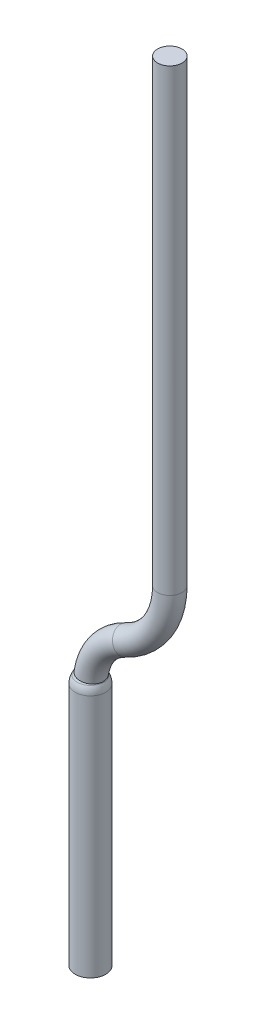
ISO-10303-21;
HEADER;
FILE_DESCRIPTION(('STEP AP214'),'2;1');
FILE_NAME('part.step','',(''),(''),'','','');
FILE_SCHEMA(('AUTOMOTIVE_DESIGN { 1 0 10303 214 1 1 1 1 }'));
ENDSEC;
DATA;
#1=APPLICATION_CONTEXT('core data for automotive mechanical design processes');
#2=APPLICATION_PROTOCOL_DEFINITION('international standard','automotive_design',2000,#1);
#3=PRODUCT_CONTEXT('',#1,'mechanical');
#4=PRODUCT('Part','Part','',(#3));
#5=PRODUCT_RELATED_PRODUCT_CATEGORY('part','',(#4));
#6=PRODUCT_DEFINITION_FORMATION('','',#4);
#7=PRODUCT_DEFINITION_CONTEXT('part definition',#1,'design');
#8=PRODUCT_DEFINITION('design','',#6,#7);
#9=PRODUCT_DEFINITION_SHAPE('','',#8);
#10=(LENGTH_UNIT() NAMED_UNIT(*) SI_UNIT(.MILLI.,.METRE.));
#11=(NAMED_UNIT(*) PLANE_ANGLE_UNIT() SI_UNIT($,.RADIAN.));
#12=(NAMED_UNIT(*) SI_UNIT($,.STERADIAN.) SOLID_ANGLE_UNIT());
#13=UNCERTAINTY_MEASURE_WITH_UNIT(LENGTH_MEASURE(1.E-05),#10,'distance_accuracy_value','');
#14=(GEOMETRIC_REPRESENTATION_CONTEXT(3) GLOBAL_UNCERTAINTY_ASSIGNED_CONTEXT((#13)) GLOBAL_UNIT_ASSIGNED_CONTEXT((#10,
#11,#12)) REPRESENTATION_CONTEXT('',''));
#15=CARTESIAN_POINT('',(0.,0.,0.));
#16=DIRECTION('',(0.,0.,1.));
#17=DIRECTION('',(1.,0.,0.));
#18=AXIS2_PLACEMENT_3D('',#15,#16,#17);
#19=CARTESIAN_POINT('',(-8.7,16.,0.));
#20=DIRECTION('',(0.,0.,-1.));
#21=DIRECTION('',(-1.,0.,0.));
#22=AXIS2_PLACEMENT_3D('',#19,#20,#21);
#23=TOROIDAL_SURFACE('',#22,4.,0.800000000000001);
#24=CARTESIAN_POINT('',(-10.3888888888889,19.6259694318882,0.));
#25=DIRECTION('',(0.90649235797205,0.422222222222223,0.));
#26=DIRECTION('',(0.,0.,1.));
#27=AXIS2_PLACEMENT_3D('',#24,#25,#26);
#28=CIRCLE('',#27,0.800000000000001);
#29=CARTESIAN_POINT('',(-10.0511111111111,18.9007755455106,0.));
#30=VERTEX_POINT('',#29);
#31=EDGE_CURVE('E48',#30,#30,#28,.T.);
#32=ORIENTED_EDGE('',*,*,#31,.F.);
#33=EDGE_LOOP('',(#32));
#34=FACE_BOUND('',#33,.T.);
#35=CARTESIAN_POINT('',(-13.2346140650629,16.6765861332044,-0.545889997202599));
#36=CARTESIAN_POINT('',(-13.2638503445764,16.6801945734031,-0.514339404259527));
#37=CARTESIAN_POINT('',(-13.2905534843033,16.6835623552442,-0.480381533787737));
#38=CARTESIAN_POINT('',(-13.3381810589157,16.6896659268197,-0.408543649052486));
#39=CARTESIAN_POINT('',(-13.3590994635792,16.6924010565723,-0.370659598108414));
#40=CARTESIAN_POINT('',(-13.3953088572261,16.6971926309274,-0.290391115693819));
#41=CARTESIAN_POINT('',(-13.410339556413,16.6992173400108,-0.247886938844708));
#42=CARTESIAN_POINT('',(-13.4331121434719,16.7023057109485,-0.160942293956431));
#43=CARTESIAN_POINT('',(-13.4408546754975,16.7033694577357,-0.116501997401575));
#44=CARTESIAN_POINT('',(-13.4488428644601,16.7044671928645,-0.0269257410162937));
#45=CARTESIAN_POINT('',(-13.4490862314188,16.7045008666584,0.0182104270989871));
#46=CARTESIAN_POINT('',(-13.4420629002413,16.7035353183585,0.107883743578252));
#47=CARTESIAN_POINT('',(-13.4347961253336,16.7025360857061,0.152420885814053));
#48=CARTESIAN_POINT('',(-13.4129527177559,16.6995701290988,0.239634374402971));
#49=CARTESIAN_POINT('',(-13.3983756379391,16.6976033459624,0.282310606756926));
#50=CARTESIAN_POINT('',(-13.3623159671288,16.6928227079279,0.364587439798731));
#51=CARTESIAN_POINT('',(-13.3408333750792,16.6900088529002,0.404188040016206));
#52=CARTESIAN_POINT('',(-13.2915666839138,16.6836894069879,0.479182609635002));
#53=CARTESIAN_POINT('',(-13.2637836013066,16.6801839277004,0.514577256214246));
#54=CARTESIAN_POINT('',(-13.2026949593381,16.6726490894042,0.580162206612931));
#55=CARTESIAN_POINT('',(-13.1693894277402,16.6686197330292,0.610352536594908));
#56=CARTESIAN_POINT('',(-13.0982054327717,16.6602034888587,0.664666790614329));
#57=CARTESIAN_POINT('',(-13.0603280444307,16.6558166851921,0.688792136679128));
#58=CARTESIAN_POINT('',(-12.9810676767912,16.6468376348628,0.730304794888743));
#59=CARTESIAN_POINT('',(-12.9396846877456,16.6422453876289,0.747692088297826));
#60=CARTESIAN_POINT('',(-12.8545638813539,16.632989621015,0.775248976130836));
#61=CARTESIAN_POINT('',(-12.8108247777748,16.6283260637213,0.785414584291591));
#62=CARTESIAN_POINT('',(-12.7222538677904,16.6190508552055,0.798231425057475));
#63=CARTESIAN_POINT('',(-12.6774220516093,16.6144392044483,0.80088259041153));
#64=CARTESIAN_POINT('',(-12.5878637156915,16.6053670551967,0.798599979621444));
#65=CARTESIAN_POINT('',(-12.5431374812625,16.6009068117267,0.793653997875128));
#66=CARTESIAN_POINT('',(-12.4551315581246,16.5922407802217,0.776298989369264));
#67=CARTESIAN_POINT('',(-12.4118518848724,16.5880349949052,0.763889882891669));
#68=CARTESIAN_POINT('',(-12.3279020343815,16.5799581292398,0.731936343318497));
#69=CARTESIAN_POINT('',(-12.2872359397098,16.5760875694054,0.712381051409085));
#70=CARTESIAN_POINT('',(-12.2097434090156,16.5687676360886,0.666690243307124));
#71=CARTESIAN_POINT('',(-12.1729169842165,16.5653182638373,0.640554707881169));
#72=CARTESIAN_POINT('',(-12.104156308862,16.5589129277779,0.582440668497111));
#73=CARTESIAN_POINT('',(-12.0722220195902,16.5559569600649,0.550462210784189));
#74=CARTESIAN_POINT('',(-12.0141632049059,16.5506028113775,0.481565731503152));
#75=CARTESIAN_POINT('',(-11.9880386235085,16.548204625028,0.444647757539857));
#76=CARTESIAN_POINT('',(-11.9423996336282,16.5440248711351,0.366995468225762));
#77=CARTESIAN_POINT('',(-11.9228724376355,16.542242110583,0.326268733302712));
#78=CARTESIAN_POINT('',(-11.8909252451863,16.5393291852251,0.242095213595235));
#79=CARTESIAN_POINT('',(-11.8785051286164,16.5381990093902,0.198648474794129));
#80=CARTESIAN_POINT('',(-11.861158207515,16.5366212401075,0.110394728625686));
#81=CARTESIAN_POINT('',(-11.8562111606271,16.5361718027298,0.0655917324004436));
#82=CARTESIAN_POINT('',(-11.8538904395378,16.5359609169845,-0.0242113599397144));
#83=CARTESIAN_POINT('',(-11.8565166853254,16.5361994613486,-0.0692114539673006));
#84=CARTESIAN_POINT('',(-11.8692563761066,16.53735768283,-0.158062444981306));
#85=CARTESIAN_POINT('',(-11.8793588859598,16.5382763651459,-0.201914923633028));
#86=CARTESIAN_POINT('',(-11.9067452687836,16.5407710555434,-0.287296882089783));
#87=CARTESIAN_POINT('',(-11.9240291588061,16.5423470651859,-0.328826356378666));
#88=CARTESIAN_POINT('',(-11.9652992663952,16.546120549503,-0.408428691200095));
#89=CARTESIAN_POINT('',(-11.9892918523782,16.5483186147053,-0.446498221561132));
#90=CARTESIAN_POINT('',(-12.0432837836932,16.5532851781888,-0.518065997864314));
#91=CARTESIAN_POINT('',(-12.0732832233075,16.5560536854236,-0.551564172041542));
#92=CARTESIAN_POINT('',(-12.1385187368157,16.5621084360195,-0.613131189074376));
#93=CARTESIAN_POINT('',(-12.1737682069798,16.5653960051761,-0.641185707068331));
#94=CARTESIAN_POINT('',(-12.2484425097738,16.5724144445972,-0.690969610972885));
#95=CARTESIAN_POINT('',(-12.2878674077746,16.5761453218023,-0.712698897835128));
#96=CARTESIAN_POINT('',(-12.3698691904905,16.5839830415131,-0.749263946164639));
#97=CARTESIAN_POINT('',(-12.4124531088517,16.5880907281132,-0.764083754915082));
#98=CARTESIAN_POINT('',(-12.4994809133569,16.5965904904515,-0.786334967572129));
#99=CARTESIAN_POINT('',(-12.5439247447951,16.6009825578273,-0.793766588629547));
#100=CARTESIAN_POINT('',(-12.6334278463672,16.6099603343431,-0.801029526439613));
#101=CARTESIAN_POINT('',(-12.6784873523118,16.6145461191704,-0.800857844543569));
#102=CARTESIAN_POINT('',(-12.7679312764777,16.6238073494,-0.792903691065771));
#103=CARTESIAN_POINT('',(-12.8123155505852,16.6284828134741,-0.785119617297717));
#104=CARTESIAN_POINT('',(-12.8990902134599,16.6378008694156,-0.762166636417693));
#105=CARTESIAN_POINT('',(-12.9414822790691,16.6424434860295,-0.747004066449308));
#106=CARTESIAN_POINT('',(-13.0230744430402,16.6515643553008,-0.709729803682974));
#107=CARTESIAN_POINT('',(-13.0622778900539,16.6560427776049,-0.687625522796414));
#108=CARTESIAN_POINT('',(-13.1239605014584,16.6632368652565,-0.645593338243456));
#109=CARTESIAN_POINT('',(-13.1476428588117,16.6660404846615,-0.627416782498931));
#110=CARTESIAN_POINT('',(-13.1928277864363,16.6714633807898,-0.588509553383341));
#111=CARTESIAN_POINT('',(-13.21433056212,16.6740826748777,-0.567779121108326));
#112=CARTESIAN_POINT('',(-13.2346140650629,16.6765861332044,-0.545889997202599));
#113=B_SPLINE_CURVE_WITH_KNOTS('',3,(#35,#36,#37,#38,#39,#40,#41,#42,#43,#44,#45,#46,#47,#48,
#49,#50,#51,#52,#53,#54,#55,#56,#57,#58,#59,#60,#61,#62,#63,#64,#65,#66,#67,#68,#69,#70,#71,#72,
#73,#74,#75,#76,#77,#78,#79,#80,#81,#82,#83,#84,#85,#86,#87,#88,#89,#90,#91,#92,#93,#94,#95,#96,
#97,#98,#99,#100,#101,#102,#103,#104,#105,#106,#107,#108,#109,#110,#111,#112),.UNSPECIFIED.,.T.,
.F.,(4,2,2,2,2,2,2,2,2,2,2,2,2,2,2,2,2,2,2,2,2,2,2,2,2,2,2,2,2,2,2,2,2,2,2,2,2,2,4),(0.,
0.129394239685102,0.258922860570678,0.393663187025921,0.528391603544065,0.663161160920854,
0.797932095976497,0.932711275521183,1.06749047567843,1.20224794627679,1.33700473941827,
1.47172990725818,1.6064554497103,1.74125530100255,1.87605635869246,2.0110742148497,
2.1460935132381,2.28131883589889,2.41654455381461,2.55176920150096,2.68699254604727,
2.82195226716562,2.95690970732354,3.09150092766326,3.22609072606822,3.36048405512719,
3.49487770329973,3.62939936404609,3.76392313638148,3.89879624205313,4.03367145962243,
4.16885655578232,4.30403767851561,4.43927211548721,4.57453502148768,4.70968195919501,
4.84468508354066,4.93446449762977,5.02423544267239),.UNSPECIFIED.);
#114=CARTESIAN_POINT('',(-13.2346140650629,16.6765861332044,-0.545889997202599));
#115=VERTEX_POINT('',#114);
#116=EDGE_CURVE('E36',#115,#115,#113,.T.);
#117=ORIENTED_EDGE('',*,*,#116,.T.);
#118=EDGE_LOOP('',(#117));
#119=FACE_BOUND('',#118,.T.);
#120=ADVANCED_FACE('F32',(#34,#119),#23,.T.);
#121=CARTESIAN_POINT('',(-7.49999999999999,24.1584312217485,0.));
#122=DIRECTION('',(0.,1.,0.));
#123=DIRECTION('',(-1.,0.,0.));
#124=AXIS2_PLACEMENT_3D('',#121,#122,#123);
#125=CYLINDRICAL_SURFACE('',#124,0.800000000000001);
#126=CARTESIAN_POINT('',(-7.49999999999999,24.1584312217485,0.));
#127=DIRECTION('',(0.,1.,0.));
#128=DIRECTION('',(0.,0.,1.));
#129=AXIS2_PLACEMENT_3D('',#126,#127,#128);
#130=CIRCLE('',#129,0.800000000000001);
#131=CARTESIAN_POINT('',(-6.69999999999999,24.1584312217485,0.));
#132=VERTEX_POINT('',#131);
#133=EDGE_CURVE('E44',#132,#132,#130,.T.);
#134=ORIENTED_EDGE('',*,*,#133,.T.);
#135=EDGE_LOOP('',(#134));
#136=FACE_BOUND('',#135,.T.);
#137=CARTESIAN_POINT('',(-7.5,54.2,0.));
#138=DIRECTION('',(0.,1.,0.));
#139=DIRECTION('',(0.,0.,1.));
#140=AXIS2_PLACEMENT_3D('',#137,#138,#139);
#141=CIRCLE('',#140,0.800000000000001);
#142=CARTESIAN_POINT('',(-7.5,54.2,0.800000000000001));
#143=VERTEX_POINT('',#142);
#144=EDGE_CURVE('E10',#143,#143,#141,.T.);
#145=ORIENTED_EDGE('',*,*,#144,.F.);
#146=EDGE_LOOP('',(#145));
#147=FACE_BOUND('',#146,.T.);
#148=ADVANCED_FACE('F34',(#136,#147),#125,.T.);
#149=CARTESIAN_POINT('',(-12.5,24.1584312217485,0.));
#150=DIRECTION('',(0.,0.,1.));
#151=DIRECTION('',(1.,0.,0.));
#152=AXIS2_PLACEMENT_3D('',#149,#150,#151);
#153=TOROIDAL_SURFACE('',#152,5.00000000000001,0.800000000000001);
#154=CARTESIAN_POINT('',(-12.5,24.1584312217485,0.));
#155=DIRECTION('',(0.,0.,1.));
#156=DIRECTION('',(1.,0.,0.));
#157=AXIS2_PLACEMENT_3D('',#154,#155,#156);
#158=CIRCLE('',#157,5.80000000000001);
#159=EDGE_CURVE('',#30,#132,#158,.T.);
#160=ORIENTED_EDGE('',*,*,#31,.T.);
#161=ORIENTED_EDGE('',*,*,#133,.F.);
#162=ORIENTED_EDGE('',*,*,#159,.T.);
#163=ORIENTED_EDGE('',*,*,#159,.F.);
#164=EDGE_LOOP('',(#160,#162,#161,#163));
#165=FACE_BOUND('',#164,.T.);
#166=ADVANCED_FACE('F91',(#165),#153,.T.);
#167=CARTESIAN_POINT('',(-7.5,54.2,0.));
#168=DIRECTION('',(0.,1.,0.));
#169=DIRECTION('',(0.,0.,1.));
#170=AXIS2_PLACEMENT_3D('',#167,#168,#169);
#171=PLANE('',#170);
#172=ORIENTED_EDGE('',*,*,#144,.T.);
#173=EDGE_LOOP('',(#172));
#174=FACE_BOUND('',#173,.T.);
#175=ADVANCED_FACE('F74',(#174),#171,.T.);
#176=CARTESIAN_POINT('',(-12.7,21.8194232190393,0.));
#177=DIRECTION('',(0.,1.,0.));
#178=DIRECTION('',(-1.,0.,0.));
#179=AXIS2_PLACEMENT_3D('',#176,#177,#178);
#180=CYLINDRICAL_SURFACE('',#179,1.);
#181=CARTESIAN_POINT('',(-12.7,16.,0.));
#182=DIRECTION('',(0.,1.,0.));
#183=DIRECTION('',(-1.,0.,0.));
#184=AXIS2_PLACEMENT_3D('',#181,#182,#183);
#185=CIRCLE('',#184,1.);
#186=CARTESIAN_POINT('',(-13.7,16.,0.));
#187=VERTEX_POINT('',#186);
#188=EDGE_CURVE('E56',#187,#187,#185,.T.);
#189=ORIENTED_EDGE('',*,*,#188,.F.);
#190=EDGE_LOOP('',(#189));
#191=FACE_BOUND('',#190,.T.);
#192=CARTESIAN_POINT('',(-12.7,0.,0.));
#193=DIRECTION('',(0.,1.,0.));
#194=DIRECTION('',(-1.,0.,0.));
#195=AXIS2_PLACEMENT_3D('',#192,#193,#194);
#196=CIRCLE('',#195,1.);
#197=CARTESIAN_POINT('',(-13.7,0.,0.));
#198=VERTEX_POINT('',#197);
#199=EDGE_CURVE('E53',#198,#198,#196,.T.);
#200=ORIENTED_EDGE('',*,*,#199,.T.);
#201=EDGE_LOOP('',(#200));
#202=FACE_BOUND('',#201,.T.);
#203=ADVANCED_FACE('F68',(#191,#202),#180,.T.);
#204=CARTESIAN_POINT('',(-12.7,16.,0.));
#205=DIRECTION('',(0.,1.,0.));
#206=DIRECTION('',(1.,0.,0.));
#207=AXIS2_PLACEMENT_3D('',#204,#205,#206);
#208=SPHERICAL_SURFACE('',#207,1.);
#209=CARTESIAN_POINT('',(-12.7,16.5,0.));
#210=DIRECTION('',(0.,1.,0.));
#211=DIRECTION('',(-1.,0.,0.));
#212=AXIS2_PLACEMENT_3D('',#209,#210,#211);
#213=CIRCLE('',#212,0.866025403784442);
#214=CARTESIAN_POINT('',(-13.5660254037844,16.5,0.));
#215=VERTEX_POINT('',#214);
#216=EDGE_CURVE('E59',#215,#215,#213,.T.);
#217=ORIENTED_EDGE('',*,*,#216,.F.);
#218=EDGE_LOOP('',(#217));
#219=FACE_BOUND('',#218,.T.);
#220=ORIENTED_EDGE('',*,*,#188,.T.);
#221=EDGE_LOOP('',(#220));
#222=FACE_BOUND('',#221,.T.);
#223=ADVANCED_FACE('F65',(#219,#222),#208,.T.);
#224=CARTESIAN_POINT('',(-12.7,16.5,0.));
#225=DIRECTION('',(0.,-1.,0.));
#226=DIRECTION('',(1.,0.,0.));
#227=AXIS2_PLACEMENT_3D('',#224,#225,#226);
#228=CONICAL_SURFACE('',#227,0.866025403784443,0.5235987755983);
#229=ORIENTED_EDGE('',*,*,#116,.F.);
#230=EDGE_LOOP('',(#229));
#231=FACE_BOUND('',#230,.T.);
#232=ORIENTED_EDGE('',*,*,#216,.T.);
#233=EDGE_LOOP('',(#232));
#234=FACE_BOUND('',#233,.T.);
#235=ADVANCED_FACE('F63',(#231,#234),#228,.T.);
#236=CARTESIAN_POINT('',(-12.7,0.,0.));
#237=DIRECTION('',(0.,1.,0.));
#238=DIRECTION('',(0.,0.,1.));
#239=AXIS2_PLACEMENT_3D('',#236,#237,#238);
#240=PLANE('',#239);
#241=ORIENTED_EDGE('',*,*,#199,.F.);
#242=EDGE_LOOP('',(#241));
#243=FACE_BOUND('',#242,.T.);
#244=ADVANCED_FACE('F78',(#243),#240,.F.);
#245=CLOSED_SHELL('',(#120,#148,#166,#175,#203,#223,#235,#244));
#246=MANIFOLD_SOLID_BREP('B2',#245);
#247=ADVANCED_BREP_SHAPE_REPRESENTATION('',(#18,#246),#14);
#248=SHAPE_DEFINITION_REPRESENTATION(#9,#247);
ENDSEC;
END-ISO-10303-21;
